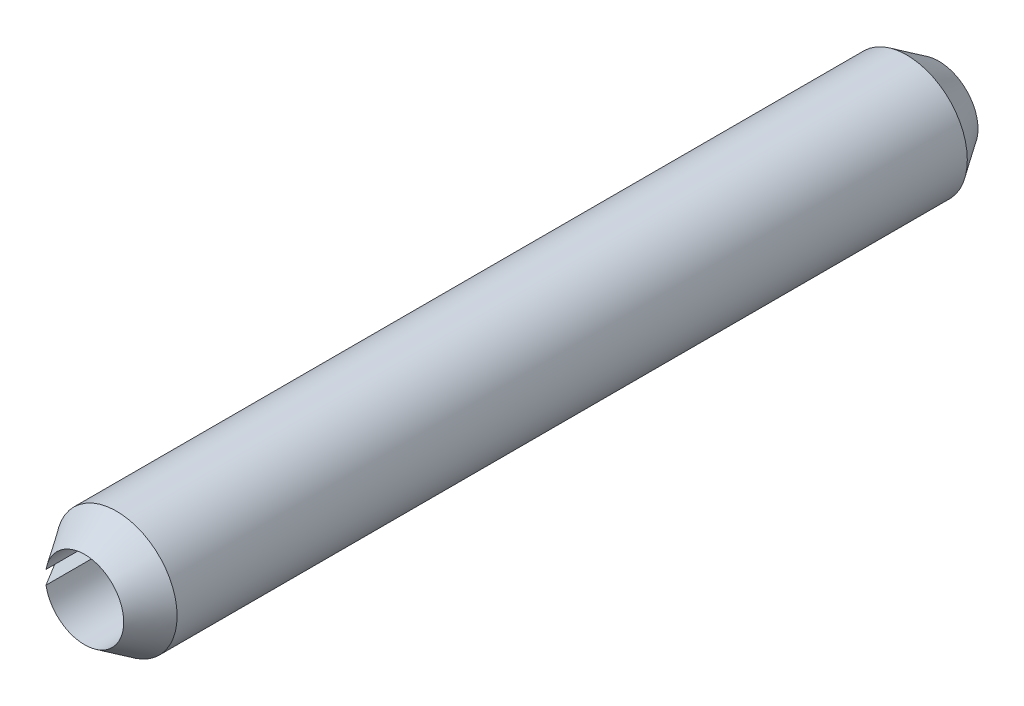
ISO-10303-21;
HEADER;
FILE_DESCRIPTION(('STEP AP214'),'2;1');
FILE_NAME('part.step','',(''),(''),'','','');
FILE_SCHEMA(('AUTOMOTIVE_DESIGN { 1 0 10303 214 1 1 1 1 }'));
ENDSEC;
DATA;
#1=APPLICATION_CONTEXT('core data for automotive mechanical design processes');
#2=APPLICATION_PROTOCOL_DEFINITION('international standard','automotive_design',2000,#1);
#3=PRODUCT_CONTEXT('',#1,'mechanical');
#4=PRODUCT('Part','Part','',(#3));
#5=PRODUCT_RELATED_PRODUCT_CATEGORY('part','',(#4));
#6=PRODUCT_DEFINITION_FORMATION('','',#4);
#7=PRODUCT_DEFINITION_CONTEXT('part definition',#1,'design');
#8=PRODUCT_DEFINITION('design','',#6,#7);
#9=PRODUCT_DEFINITION_SHAPE('','',#8);
#10=(LENGTH_UNIT() NAMED_UNIT(*) SI_UNIT(.MILLI.,.METRE.));
#11=(NAMED_UNIT(*) PLANE_ANGLE_UNIT() SI_UNIT($,.RADIAN.));
#12=(NAMED_UNIT(*) SI_UNIT($,.STERADIAN.) SOLID_ANGLE_UNIT());
#13=UNCERTAINTY_MEASURE_WITH_UNIT(LENGTH_MEASURE(1.E-05),#10,'distance_accuracy_value','');
#14=(GEOMETRIC_REPRESENTATION_CONTEXT(3) GLOBAL_UNCERTAINTY_ASSIGNED_CONTEXT((#13)) GLOBAL_UNIT_ASSIGNED_CONTEXT((#10,
#11,#12)) REPRESENTATION_CONTEXT('',''));
#15=CARTESIAN_POINT('',(0.,0.,0.));
#16=DIRECTION('',(0.,0.,1.));
#17=DIRECTION('',(1.,0.,0.));
#18=AXIS2_PLACEMENT_3D('',#15,#16,#17);
#19=CARTESIAN_POINT('',(0.,0.,6.));
#20=DIRECTION('',(0.,0.,-1.));
#21=DIRECTION('',(-1.,0.,0.));
#22=AXIS2_PLACEMENT_3D('',#19,#20,#21);
#23=CYLINDRICAL_SURFACE('',#22,0.55);
#24=CARTESIAN_POINT('',(0.,0.,-6.));
#25=DIRECTION('',(0.,0.,-1.));
#26=DIRECTION('',(1.,0.,0.));
#27=AXIS2_PLACEMENT_3D('',#24,#25,#26);
#28=CIRCLE('',#27,0.55);
#29=CARTESIAN_POINT('',(-0.541644264156716,0.0955064977168099,-6.));
#30=VERTEX_POINT('',#29);
#31=CARTESIAN_POINT('',(-0.541644264156715,-0.0955064977168097,-6.));
#32=VERTEX_POINT('',#31);
#33=EDGE_CURVE('E95',#30,#32,#28,.T.);
#34=ORIENTED_EDGE('',*,*,#33,.T.);
#35=DIRECTION('',(0.,0.,-1.));
#36=VECTOR('',#35,1.);
#37=CARTESIAN_POINT('',(-0.541644264156715,-0.0955064977168097,6.));
#38=LINE('',#37,#36);
#39=CARTESIAN_POINT('',(-0.541644264156717,-0.0955064977168101,6.));
#40=VERTEX_POINT('',#39);
#41=EDGE_CURVE('E11',#40,#32,#38,.T.);
#42=ORIENTED_EDGE('',*,*,#41,.F.);
#43=CARTESIAN_POINT('',(0.,0.,6.));
#44=DIRECTION('',(0.,0.,-1.));
#45=DIRECTION('',(1.,0.,0.));
#46=AXIS2_PLACEMENT_3D('',#43,#44,#45);
#47=CIRCLE('',#46,0.55);
#48=CARTESIAN_POINT('',(-0.541644264156715,0.0955064977168097,6.));
#49=VERTEX_POINT('',#48);
#50=EDGE_CURVE('E92',#49,#40,#47,.T.);
#51=ORIENTED_EDGE('',*,*,#50,.F.);
#52=DIRECTION('',(0.,0.,-1.));
#53=VECTOR('',#52,1.);
#54=CARTESIAN_POINT('',(-0.541644264156715,0.0955064977168097,6.));
#55=LINE('',#54,#53);
#56=EDGE_CURVE('E84',#49,#30,#55,.T.);
#57=ORIENTED_EDGE('',*,*,#56,.T.);
#58=EDGE_LOOP('',(#34,#42,#51,#57));
#59=FACE_BOUND('',#58,.T.);
#60=ADVANCED_FACE('F36',(#59),#23,.F.);
#61=CARTESIAN_POINT('',(-0.541644264156715,-0.0955064977168097,6.));
#62=DIRECTION('',(0.173648177666928,-0.984807753012209,0.));
#63=DIRECTION('',(0.984807753012209,0.173648177666928,0.));
#64=AXIS2_PLACEMENT_3D('',#61,#62,#63);
#65=PLANE('',#64);
#66=DIRECTION('',(0.,0.,-1.));
#67=VECTOR('',#66,1.);
#68=CARTESIAN_POINT('',(-0.837086590060377,-0.147600951016888,6.));
#69=LINE('',#68,#67);
#70=CARTESIAN_POINT('',(-0.837086590060381,-0.147600951016889,5.55));
#71=VERTEX_POINT('',#70);
#72=CARTESIAN_POINT('',(-0.837086590060381,-0.147600951016889,-5.55));
#73=VERTEX_POINT('',#72);
#74=EDGE_CURVE('E44',#71,#73,#69,.T.);
#75=ORIENTED_EDGE('',*,*,#74,.F.);
#76=DIRECTION('',(-0.546273053840001,-0.0963226782259988,-0.832050294337842));
#77=VECTOR('',#76,1.);
#78=CARTESIAN_POINT('',(0.,0.,6.825));
#79=LINE('',#78,#77);
#80=EDGE_CURVE('E73',#71,#40,#79,.F.);
#81=ORIENTED_EDGE('',*,*,#80,.T.);
#82=ORIENTED_EDGE('',*,*,#41,.T.);
#83=DIRECTION('',(0.546273053840001,0.0963226782259988,-0.832050294337842));
#84=VECTOR('',#83,1.);
#85=CARTESIAN_POINT('',(0.,0.,-6.825));
#86=LINE('',#85,#84);
#87=EDGE_CURVE('E98',#32,#73,#86,.F.);
#88=ORIENTED_EDGE('',*,*,#87,.T.);
#89=EDGE_LOOP('',(#75,#81,#82,#88));
#90=FACE_BOUND('',#89,.T.);
#91=ADVANCED_FACE('F107',(#90),#65,.F.);
#92=CARTESIAN_POINT('',(0.,0.,6.));
#93=DIRECTION('',(0.,0.,-1.));
#94=DIRECTION('',(-1.,0.,0.));
#95=AXIS2_PLACEMENT_3D('',#92,#93,#94);
#96=CYLINDRICAL_SURFACE('',#95,0.85);
#97=DIRECTION('',(0.,0.,-1.));
#98=VECTOR('',#97,1.);
#99=CARTESIAN_POINT('',(-0.837086590060377,0.147600951016888,6.));
#100=LINE('',#99,#98);
#101=CARTESIAN_POINT('',(-0.83708659006038,0.147600951016889,5.55));
#102=VERTEX_POINT('',#101);
#103=CARTESIAN_POINT('',(-0.837086590060379,0.147600951016888,-5.55));
#104=VERTEX_POINT('',#103);
#105=EDGE_CURVE('E81',#102,#104,#100,.T.);
#106=ORIENTED_EDGE('',*,*,#105,.F.);
#107=CARTESIAN_POINT('',(0.,0.,5.55));
#108=DIRECTION('',(0.,0.,-1.));
#109=DIRECTION('',(-1.,0.,0.));
#110=AXIS2_PLACEMENT_3D('',#107,#108,#109);
#111=CIRCLE('',#110,0.850000000000003);
#112=EDGE_CURVE('E70',#102,#71,#111,.T.);
#113=ORIENTED_EDGE('',*,*,#112,.T.);
#114=ORIENTED_EDGE('',*,*,#74,.T.);
#115=CARTESIAN_POINT('',(0.,0.,-5.55));
#116=DIRECTION('',(0.,0.,-1.));
#117=DIRECTION('',(-1.,0.,0.));
#118=AXIS2_PLACEMENT_3D('',#115,#116,#117);
#119=CIRCLE('',#118,0.850000000000003);
#120=EDGE_CURVE('E90',#104,#73,#119,.T.);
#121=ORIENTED_EDGE('',*,*,#120,.F.);
#122=EDGE_LOOP('',(#106,#113,#114,#121));
#123=FACE_BOUND('',#122,.T.);
#124=ADVANCED_FACE('F88',(#123),#96,.T.);
#125=CARTESIAN_POINT('',(-0.837086590060377,0.147600951016888,6.));
#126=DIRECTION('',(0.173648177666928,0.984807753012209,0.));
#127=DIRECTION('',(-0.984807753012209,0.173648177666928,0.));
#128=AXIS2_PLACEMENT_3D('',#125,#126,#127);
#129=PLANE('',#128);
#130=ORIENTED_EDGE('',*,*,#56,.F.);
#131=DIRECTION('',(0.546273053840001,-0.0963226782259988,0.832050294337842));
#132=VECTOR('',#131,1.);
#133=CARTESIAN_POINT('',(0.,0.,6.825));
#134=LINE('',#133,#132);
#135=EDGE_CURVE('E50',#49,#102,#134,.F.);
#136=ORIENTED_EDGE('',*,*,#135,.T.);
#137=ORIENTED_EDGE('',*,*,#105,.T.);
#138=DIRECTION('',(-0.546273053840001,0.0963226782259988,0.832050294337842));
#139=VECTOR('',#138,1.);
#140=CARTESIAN_POINT('',(0.,0.,-6.825));
#141=LINE('',#140,#139);
#142=EDGE_CURVE('E102',#104,#30,#141,.F.);
#143=ORIENTED_EDGE('',*,*,#142,.T.);
#144=EDGE_LOOP('',(#130,#136,#137,#143));
#145=FACE_BOUND('',#144,.T.);
#146=ADVANCED_FACE('F79',(#145),#129,.F.);
#147=CARTESIAN_POINT('',(0.,0.,-5.55));
#148=DIRECTION('',(0.,0.,1.));
#149=DIRECTION('',(1.,0.,0.));
#150=AXIS2_PLACEMENT_3D('',#147,#148,#149);
#151=CONICAL_SURFACE('',#150,0.850000000000003,0.58800260354757);
#152=ORIENTED_EDGE('',*,*,#33,.F.);
#153=ORIENTED_EDGE('',*,*,#142,.F.);
#154=ORIENTED_EDGE('',*,*,#120,.T.);
#155=ORIENTED_EDGE('',*,*,#87,.F.);
#156=EDGE_LOOP('',(#152,#153,#154,#155));
#157=FACE_BOUND('',#156,.T.);
#158=ADVANCED_FACE('F110',(#157),#151,.T.);
#159=CARTESIAN_POINT('',(0.,0.,6.));
#160=DIRECTION('',(0.,0.,-1.));
#161=DIRECTION('',(-1.,0.,0.));
#162=AXIS2_PLACEMENT_3D('',#159,#160,#161);
#163=CONICAL_SURFACE('',#162,0.550000000000002,0.58800260354757);
#164=ORIENTED_EDGE('',*,*,#112,.F.);
#165=ORIENTED_EDGE('',*,*,#135,.F.);
#166=ORIENTED_EDGE('',*,*,#50,.T.);
#167=ORIENTED_EDGE('',*,*,#80,.F.);
#168=EDGE_LOOP('',(#164,#165,#166,#167));
#169=FACE_BOUND('',#168,.T.);
#170=ADVANCED_FACE('F71',(#169),#163,.T.);
#171=CLOSED_SHELL('',(#60,#91,#124,#146,#158,#170));
#172=MANIFOLD_SOLID_BREP('B2',#171);
#173=ADVANCED_BREP_SHAPE_REPRESENTATION('',(#18,#172),#14);
#174=SHAPE_DEFINITION_REPRESENTATION(#9,#173);
ENDSEC;
END-ISO-10303-21;
